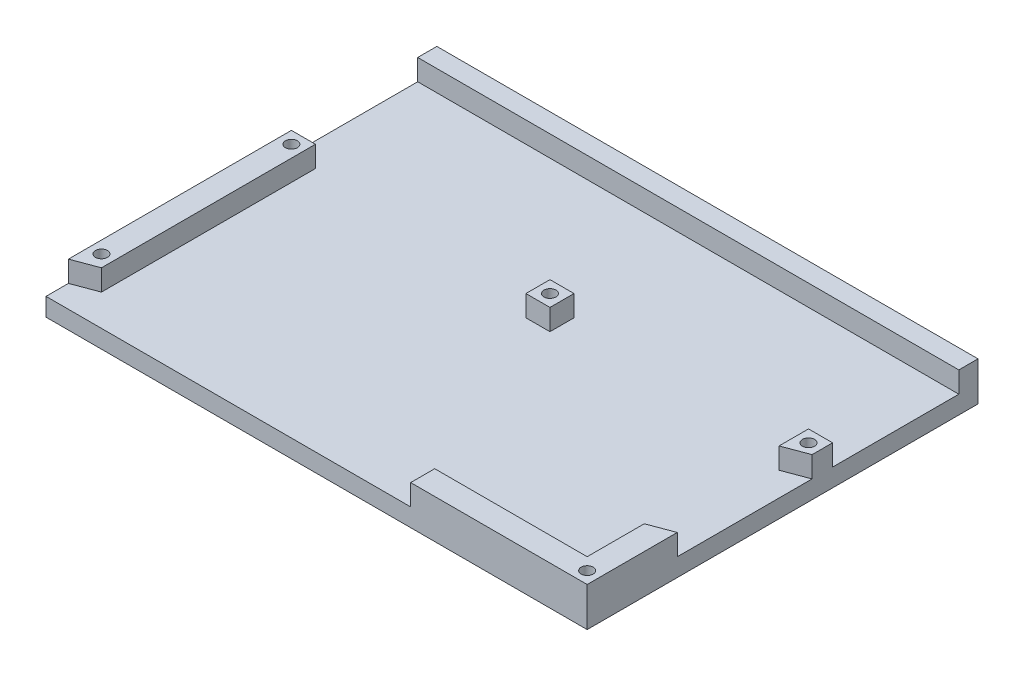
ISO-10303-21;
HEADER;
FILE_DESCRIPTION(('STEP AP214'),'2;1');
FILE_NAME('part.step','',(''),(''),'','','');
FILE_SCHEMA(('AUTOMOTIVE_DESIGN { 1 0 10303 214 1 1 1 1 }'));
ENDSEC;
DATA;
#1=APPLICATION_CONTEXT('core data for automotive mechanical design processes');
#2=APPLICATION_PROTOCOL_DEFINITION('international standard','automotive_design',2000,#1);
#3=PRODUCT_CONTEXT('',#1,'mechanical');
#4=PRODUCT('Part','Part','',(#3));
#5=PRODUCT_RELATED_PRODUCT_CATEGORY('part','',(#4));
#6=PRODUCT_DEFINITION_FORMATION('','',#4);
#7=PRODUCT_DEFINITION_CONTEXT('part definition',#1,'design');
#8=PRODUCT_DEFINITION('design','',#6,#7);
#9=PRODUCT_DEFINITION_SHAPE('','',#8);
#10=(LENGTH_UNIT() NAMED_UNIT(*) SI_UNIT(.MILLI.,.METRE.));
#11=(NAMED_UNIT(*) PLANE_ANGLE_UNIT() SI_UNIT($,.RADIAN.));
#12=(NAMED_UNIT(*) SI_UNIT($,.STERADIAN.) SOLID_ANGLE_UNIT());
#13=UNCERTAINTY_MEASURE_WITH_UNIT(LENGTH_MEASURE(1.E-05),#10,'distance_accuracy_value','');
#14=(GEOMETRIC_REPRESENTATION_CONTEXT(3) GLOBAL_UNCERTAINTY_ASSIGNED_CONTEXT((#13)) GLOBAL_UNIT_ASSIGNED_CONTEXT((#10,
#11,#12)) REPRESENTATION_CONTEXT('',''));
#15=CARTESIAN_POINT('',(0.,0.,0.));
#16=DIRECTION('',(0.,0.,1.));
#17=DIRECTION('',(1.,0.,0.));
#18=AXIS2_PLACEMENT_3D('',#15,#16,#17);
#19=CARTESIAN_POINT('',(0.,3.,0.));
#20=DIRECTION('',(0.,-1.,0.));
#21=DIRECTION('',(0.,0.,-1.));
#22=AXIS2_PLACEMENT_3D('',#19,#20,#21);
#23=PLANE('',#22);
#24=DIRECTION('',(1.,0.,0.));
#25=VECTOR('',#24,1.);
#26=CARTESIAN_POINT('',(0.,3.,-40.8129121657159));
#27=LINE('',#26,#25);
#28=CARTESIAN_POINT('',(43.,3.,-40.8129121657159));
#29=VERTEX_POINT('',#28);
#30=CARTESIAN_POINT('',(47.,3.,-40.8129121657159));
#31=VERTEX_POINT('',#30);
#32=EDGE_CURVE('E326',#29,#31,#27,.T.);
#33=ORIENTED_EDGE('',*,*,#32,.T.);
#34=DIRECTION('',(0.,0.,1.));
#35=VECTOR('',#34,1.);
#36=CARTESIAN_POINT('',(47.,3.,0.));
#37=LINE('',#36,#35);
#38=CARTESIAN_POINT('',(47.,3.,-36.8129121657159));
#39=VERTEX_POINT('',#38);
#40=EDGE_CURVE('E307',#31,#39,#37,.T.);
#41=ORIENTED_EDGE('',*,*,#40,.T.);
#42=DIRECTION('',(1.,0.,0.));
#43=VECTOR('',#42,1.);
#44=CARTESIAN_POINT('',(0.,3.,-36.8129121657159));
#45=LINE('',#44,#43);
#46=CARTESIAN_POINT('',(43.,3.,-36.8129121657159));
#47=VERTEX_POINT('',#46);
#48=EDGE_CURVE('E313',#47,#39,#45,.T.);
#49=ORIENTED_EDGE('',*,*,#48,.F.);
#50=DIRECTION('',(0.,0.,1.));
#51=VECTOR('',#50,1.);
#52=CARTESIAN_POINT('',(43.,3.,0.));
#53=LINE('',#52,#51);
#54=EDGE_CURVE('E329',#29,#47,#53,.T.);
#55=ORIENTED_EDGE('',*,*,#54,.F.);
#56=EDGE_LOOP('',(#33,#41,#49,#55));
#57=FACE_BOUND('',#56,.T.);
#58=DIRECTION('',(0.936563452995251,0.,-0.350498072054059));
#59=VECTOR('',#58,1.);
#60=CARTESIAN_POINT('',(-1.22321837614956,3.,-3.26855328881005));
#61=LINE('',#60,#59);
#62=CARTESIAN_POINT('',(86.0000000000064,3.,-35.9108369284513));
#63=VERTEX_POINT('',#62);
#64=CARTESIAN_POINT('',(90.,3.,-37.4077908013959));
#65=VERTEX_POINT('',#64);
#66=EDGE_CURVE('E63',#63,#65,#61,.T.);
#67=ORIENTED_EDGE('',*,*,#66,.F.);
#68=DIRECTION('',(-1.29943019955387E-12,0.,-1.));
#69=VECTOR('',#68,1.);
#70=CARTESIAN_POINT('',(86.000000000053,3.,-1.11750997161702E-10));
#71=LINE('',#70,#69);
#72=CARTESIAN_POINT('',(86.,3.,-40.8129121657159));
#73=VERTEX_POINT('',#72);
#74=EDGE_CURVE('E68',#63,#73,#71,.T.);
#75=ORIENTED_EDGE('',*,*,#74,.T.);
#76=DIRECTION('',(-1.,0.,0.));
#77=VECTOR('',#76,1.);
#78=CARTESIAN_POINT('',(0.,3.,-40.8129121657159));
#79=LINE('',#78,#77);
#80=CARTESIAN_POINT('',(90.,3.,-40.8129121657159));
#81=VERTEX_POINT('',#80);
#82=EDGE_CURVE('E226',#81,#73,#79,.T.);
#83=ORIENTED_EDGE('',*,*,#82,.F.);
#84=DIRECTION('',(0.,0.,-1.));
#85=VECTOR('',#84,1.);
#86=CARTESIAN_POINT('',(90.,3.,0.));
#87=LINE('',#86,#85);
#88=CARTESIAN_POINT('',(90.,3.,-61.8129121657159));
#89=VERTEX_POINT('',#88);
#90=EDGE_CURVE('E427',#81,#89,#87,.T.);
#91=ORIENTED_EDGE('',*,*,#90,.T.);
#92=DIRECTION('',(1.,0.,0.));
#93=VECTOR('',#92,1.);
#94=CARTESIAN_POINT('',(0.,3.,-61.8129121657159));
#95=LINE('',#94,#93);
#96=CARTESIAN_POINT('',(0.,3.,-61.8129121657159));
#97=VERTEX_POINT('',#96);
#98=EDGE_CURVE('E392',#97,#89,#95,.T.);
#99=ORIENTED_EDGE('',*,*,#98,.F.);
#100=DIRECTION('',(0.,0.,1.));
#101=VECTOR('',#100,1.);
#102=CARTESIAN_POINT('',(0.,3.,0.));
#103=LINE('',#102,#101);
#104=CARTESIAN_POINT('',(0.,3.,-40.8129121657159));
#105=VERTEX_POINT('',#104);
#106=EDGE_CURVE('E420',#97,#105,#103,.T.);
#107=ORIENTED_EDGE('',*,*,#106,.T.);
#108=DIRECTION('',(1.,0.,0.));
#109=VECTOR('',#108,1.);
#110=CARTESIAN_POINT('',(0.,3.,-40.8129121657159));
#111=LINE('',#110,#109);
#112=CARTESIAN_POINT('',(3.99999999999997,3.,-40.8129121657159));
#113=VERTEX_POINT('',#112);
#114=EDGE_CURVE('E357',#105,#113,#111,.T.);
#115=ORIENTED_EDGE('',*,*,#114,.T.);
#116=DIRECTION('',(2.68789889276363E-13,0.,1.));
#117=VECTOR('',#116,1.);
#118=CARTESIAN_POINT('',(4.00000000001094,3.,-1.07515955710839E-12));
#119=LINE('',#118,#117);
#120=CARTESIAN_POINT('',(4.00000000000954,3.,-5.22328253333626));
#121=VERTEX_POINT('',#120);
#122=EDGE_CURVE('E372',#113,#121,#119,.T.);
#123=ORIENTED_EDGE('',*,*,#122,.T.);
#124=DIRECTION('',(-0.936563452995251,0.,0.350498072054059));
#125=VECTOR('',#124,1.);
#126=CARTESIAN_POINT('',(-1.22321837620675,3.,-3.26855328896287));
#127=LINE('',#126,#125);
#128=CARTESIAN_POINT('',(0.,3.,-3.72632866039169));
#129=VERTEX_POINT('',#128);
#130=EDGE_CURVE('E351',#121,#129,#127,.T.);
#131=ORIENTED_EDGE('',*,*,#130,.T.);
#132=CARTESIAN_POINT('',(0.,3.,0.));
#133=VERTEX_POINT('',#132);
#134=EDGE_CURVE('E424',#129,#133,#103,.T.);
#135=ORIENTED_EDGE('',*,*,#134,.T.);
#136=DIRECTION('',(1.,0.,0.));
#137=VECTOR('',#136,1.);
#138=CARTESIAN_POINT('',(0.,3.,0.));
#139=LINE('',#138,#137);
#140=CARTESIAN_POINT('',(60.6460128306891,3.,0.));
#141=VERTEX_POINT('',#140);
#142=EDGE_CURVE('E423',#133,#141,#139,.T.);
#143=ORIENTED_EDGE('',*,*,#142,.T.);
#144=DIRECTION('',(0.,0.,1.));
#145=VECTOR('',#144,1.);
#146=CARTESIAN_POINT('',(60.6460128306891,3.,0.));
#147=LINE('',#146,#145);
#148=CARTESIAN_POINT('',(60.6460128306891,3.,-4.));
#149=VERTEX_POINT('',#148);
#150=EDGE_CURVE('E257',#149,#141,#147,.T.);
#151=ORIENTED_EDGE('',*,*,#150,.F.);
#152=DIRECTION('',(1.,0.,0.));
#153=VECTOR('',#152,1.);
#154=CARTESIAN_POINT('',(0.,3.,-3.99999999999999));
#155=LINE('',#154,#153);
#156=CARTESIAN_POINT('',(86.,3.,-4.));
#157=VERTEX_POINT('',#156);
#158=EDGE_CURVE('E282',#149,#157,#155,.T.);
#159=ORIENTED_EDGE('',*,*,#158,.T.);
#160=DIRECTION('',(0.,0.,-1.));
#161=VECTOR('',#160,1.);
#162=CARTESIAN_POINT('',(86.,3.,0.));
#163=LINE('',#162,#161);
#164=CARTESIAN_POINT('',(86.,3.,-13.4884373218481));
#165=VERTEX_POINT('',#164);
#166=EDGE_CURVE('E279',#157,#165,#163,.T.);
#167=ORIENTED_EDGE('',*,*,#166,.T.);
#168=DIRECTION('',(0.936563452995869,0.,-0.350498072052407));
#169=VECTOR('',#168,1.);
#170=CARTESIAN_POINT('',(6.13724113690313,3.,16.3992792239578));
#171=LINE('',#170,#169);
#172=CARTESIAN_POINT('',(90.,3.,-14.985391194781));
#173=VERTEX_POINT('',#172);
#174=EDGE_CURVE('E209',#165,#173,#171,.T.);
#175=ORIENTED_EDGE('',*,*,#174,.T.);
#176=EDGE_CURVE('E428',#173,#65,#87,.T.);
#177=ORIENTED_EDGE('',*,*,#176,.T.);
#178=EDGE_LOOP('',(#67,#75,#83,#91,#99,#107,#115,#123,#131,#135,#143,#151,#159,#167,#175,#177));
#179=FACE_BOUND('',#178,.T.);
#180=ADVANCED_FACE('F47',(#57,#179),#23,.F.);
#181=CARTESIAN_POINT('',(0.,3.,0.));
#182=DIRECTION('',(1.,0.,0.));
#183=DIRECTION('',(0.,0.,-1.));
#184=AXIS2_PLACEMENT_3D('',#181,#182,#183);
#185=PLANE('',#184);
#186=DIRECTION('',(0.,0.,1.));
#187=VECTOR('',#186,1.);
#188=CARTESIAN_POINT('',(0.,0.,0.));
#189=LINE('',#188,#187);
#190=CARTESIAN_POINT('',(0.,0.,-65.));
#191=VERTEX_POINT('',#190);
#192=CARTESIAN_POINT('',(0.,0.,0.));
#193=VERTEX_POINT('',#192);
#194=EDGE_CURVE('E419',#191,#193,#189,.T.);
#195=ORIENTED_EDGE('',*,*,#194,.T.);
#196=DIRECTION('',(0.,-1.,0.));
#197=VECTOR('',#196,1.);
#198=CARTESIAN_POINT('',(0.,3.,0.));
#199=LINE('',#198,#197);
#200=EDGE_CURVE('E11',#133,#193,#199,.T.);
#201=ORIENTED_EDGE('',*,*,#200,.F.);
#202=ORIENTED_EDGE('',*,*,#134,.F.);
#203=DIRECTION('',(0.,-1.,0.));
#204=VECTOR('',#203,1.);
#205=CARTESIAN_POINT('',(0.,6.5,-3.72632866039169));
#206=LINE('',#205,#204);
#207=CARTESIAN_POINT('',(0.,6.5,-3.72632866039169));
#208=VERTEX_POINT('',#207);
#209=EDGE_CURVE('E368',#208,#129,#206,.T.);
#210=ORIENTED_EDGE('',*,*,#209,.F.);
#211=DIRECTION('',(0.,0.,1.));
#212=VECTOR('',#211,1.);
#213=CARTESIAN_POINT('',(0.,6.5,0.));
#214=LINE('',#213,#212);
#215=CARTESIAN_POINT('',(0.,6.5,-40.8129121657159));
#216=VERTEX_POINT('',#215);
#217=EDGE_CURVE('E365',#216,#208,#214,.T.);
#218=ORIENTED_EDGE('',*,*,#217,.F.);
#219=DIRECTION('',(0.,-1.,0.));
#220=VECTOR('',#219,1.);
#221=CARTESIAN_POINT('',(0.,6.5,-40.8129121657159));
#222=LINE('',#221,#220);
#223=EDGE_CURVE('E380',#216,#105,#222,.T.);
#224=ORIENTED_EDGE('',*,*,#223,.T.);
#225=ORIENTED_EDGE('',*,*,#106,.F.);
#226=DIRECTION('',(0.,-1.,0.));
#227=VECTOR('',#226,1.);
#228=CARTESIAN_POINT('',(0.,6.5,-61.8129121657159));
#229=LINE('',#228,#227);
#230=CARTESIAN_POINT('',(0.,6.5,-61.8129121657159));
#231=VERTEX_POINT('',#230);
#232=EDGE_CURVE('E415',#231,#97,#229,.T.);
#233=ORIENTED_EDGE('',*,*,#232,.F.);
#234=DIRECTION('',(0.,0.,1.));
#235=VECTOR('',#234,1.);
#236=CARTESIAN_POINT('',(0.,6.5,0.));
#237=LINE('',#236,#235);
#238=CARTESIAN_POINT('',(0.,6.5,-65.));
#239=VERTEX_POINT('',#238);
#240=EDGE_CURVE('E393',#239,#231,#237,.T.);
#241=ORIENTED_EDGE('',*,*,#240,.F.);
#242=DIRECTION('',(0.,-1.,0.));
#243=VECTOR('',#242,1.);
#244=CARTESIAN_POINT('',(0.,3.,-65.));
#245=LINE('',#244,#243);
#246=EDGE_CURVE('E431',#239,#191,#245,.T.);
#247=ORIENTED_EDGE('',*,*,#246,.T.);
#248=EDGE_LOOP('',(#195,#201,#202,#210,#218,#224,#225,#233,#241,#247));
#249=FACE_BOUND('',#248,.T.);
#250=ADVANCED_FACE('F49',(#249),#185,.F.);
#251=CARTESIAN_POINT('',(0.,3.,0.));
#252=DIRECTION('',(0.,0.,-1.));
#253=DIRECTION('',(-1.,0.,0.));
#254=AXIS2_PLACEMENT_3D('',#251,#252,#253);
#255=PLANE('',#254);
#256=DIRECTION('',(1.,0.,0.));
#257=VECTOR('',#256,1.);
#258=CARTESIAN_POINT('',(0.,0.,0.));
#259=LINE('',#258,#257);
#260=CARTESIAN_POINT('',(90.,0.,0.));
#261=VERTEX_POINT('',#260);
#262=EDGE_CURVE('E435',#193,#261,#259,.T.);
#263=ORIENTED_EDGE('',*,*,#262,.T.);
#264=DIRECTION('',(0.,-1.,0.));
#265=VECTOR('',#264,1.);
#266=CARTESIAN_POINT('',(90.,3.,0.));
#267=LINE('',#266,#265);
#268=CARTESIAN_POINT('',(90.,6.5,0.));
#269=VERTEX_POINT('',#268);
#270=EDGE_CURVE('E56',#269,#261,#267,.T.);
#271=ORIENTED_EDGE('',*,*,#270,.F.);
#272=DIRECTION('',(1.,0.,0.));
#273=VECTOR('',#272,1.);
#274=CARTESIAN_POINT('',(0.,6.5,0.));
#275=LINE('',#274,#273);
#276=CARTESIAN_POINT('',(60.6460128306891,6.5,0.));
#277=VERTEX_POINT('',#276);
#278=EDGE_CURVE('E268',#277,#269,#275,.T.);
#279=ORIENTED_EDGE('',*,*,#278,.F.);
#280=DIRECTION('',(0.,-1.,0.));
#281=VECTOR('',#280,1.);
#282=CARTESIAN_POINT('',(60.6460128306891,6.5,0.));
#283=LINE('',#282,#281);
#284=EDGE_CURVE('E291',#277,#141,#283,.T.);
#285=ORIENTED_EDGE('',*,*,#284,.T.);
#286=ORIENTED_EDGE('',*,*,#142,.F.);
#287=ORIENTED_EDGE('',*,*,#200,.T.);
#288=EDGE_LOOP('',(#263,#271,#279,#285,#286,#287));
#289=FACE_BOUND('',#288,.T.);
#290=ADVANCED_FACE('F495',(#289),#255,.F.);
#291=CARTESIAN_POINT('',(90.,3.,0.));
#292=DIRECTION('',(-1.,0.,0.));
#293=DIRECTION('',(0.,0.,1.));
#294=AXIS2_PLACEMENT_3D('',#291,#292,#293);
#295=PLANE('',#294);
#296=DIRECTION('',(0.,0.,-1.));
#297=VECTOR('',#296,1.);
#298=CARTESIAN_POINT('',(90.,0.,0.));
#299=LINE('',#298,#297);
#300=CARTESIAN_POINT('',(90.,0.,-65.));
#301=VERTEX_POINT('',#300);
#302=EDGE_CURVE('E438',#261,#301,#299,.T.);
#303=ORIENTED_EDGE('',*,*,#302,.T.);
#304=DIRECTION('',(0.,-1.,0.));
#305=VECTOR('',#304,1.);
#306=CARTESIAN_POINT('',(90.,3.,-65.));
#307=LINE('',#306,#305);
#308=CARTESIAN_POINT('',(89.9999999999999,6.5,-65.));
#309=VERTEX_POINT('',#308);
#310=EDGE_CURVE('E447',#309,#301,#307,.T.);
#311=ORIENTED_EDGE('',*,*,#310,.F.);
#312=DIRECTION('',(0.,0.,-1.));
#313=VECTOR('',#312,1.);
#314=CARTESIAN_POINT('',(90.,6.5,0.));
#315=LINE('',#314,#313);
#316=CARTESIAN_POINT('',(90.,6.5,-61.8129121657159));
#317=VERTEX_POINT('',#316);
#318=EDGE_CURVE('E400',#317,#309,#315,.T.);
#319=ORIENTED_EDGE('',*,*,#318,.F.);
#320=DIRECTION('',(0.,-1.,0.));
#321=VECTOR('',#320,1.);
#322=CARTESIAN_POINT('',(90.,6.5,-61.8129121657159));
#323=LINE('',#322,#321);
#324=EDGE_CURVE('E408',#317,#89,#323,.T.);
#325=ORIENTED_EDGE('',*,*,#324,.T.);
#326=ORIENTED_EDGE('',*,*,#90,.F.);
#327=DIRECTION('',(0.,-1.,0.));
#328=VECTOR('',#327,1.);
#329=CARTESIAN_POINT('',(90.,6.5,-40.8129121657159));
#330=LINE('',#329,#328);
#331=CARTESIAN_POINT('',(90.,6.5,-40.8129121657159));
#332=VERTEX_POINT('',#331);
#333=EDGE_CURVE('E246',#332,#81,#330,.T.);
#334=ORIENTED_EDGE('',*,*,#333,.F.);
#335=DIRECTION('',(0.,0.,-1.));
#336=VECTOR('',#335,1.);
#337=CARTESIAN_POINT('',(90.,6.5,0.));
#338=LINE('',#337,#336);
#339=CARTESIAN_POINT('',(90.,6.5,-37.4077908013959));
#340=VERTEX_POINT('',#339);
#341=EDGE_CURVE('E219',#340,#332,#338,.T.);
#342=ORIENTED_EDGE('',*,*,#341,.F.);
#343=DIRECTION('',(0.,-1.,0.));
#344=VECTOR('',#343,1.);
#345=CARTESIAN_POINT('',(90.,6.5,-37.4077908013959));
#346=LINE('',#345,#344);
#347=EDGE_CURVE('E210',#340,#65,#346,.T.);
#348=ORIENTED_EDGE('',*,*,#347,.T.);
#349=ORIENTED_EDGE('',*,*,#176,.F.);
#350=DIRECTION('',(0.,-1.,0.));
#351=VECTOR('',#350,1.);
#352=CARTESIAN_POINT('',(90.,6.5,-14.985391194781));
#353=LINE('',#352,#351);
#354=CARTESIAN_POINT('',(90.,6.5,-14.985391194781));
#355=VERTEX_POINT('',#354);
#356=EDGE_CURVE('E275',#355,#173,#353,.T.);
#357=ORIENTED_EDGE('',*,*,#356,.F.);
#358=DIRECTION('',(0.,0.,-1.));
#359=VECTOR('',#358,1.);
#360=CARTESIAN_POINT('',(90.,6.5,0.));
#361=LINE('',#360,#359);
#362=EDGE_CURVE('E272',#269,#355,#361,.T.);
#363=ORIENTED_EDGE('',*,*,#362,.F.);
#364=ORIENTED_EDGE('',*,*,#270,.T.);
#365=EDGE_LOOP('',(#303,#311,#319,#325,#326,#334,#342,#348,#349,#357,#363,#364));
#366=FACE_BOUND('',#365,.T.);
#367=ADVANCED_FACE('F455',(#366),#295,.F.);
#368=CARTESIAN_POINT('',(0.,3.,-65.));
#369=DIRECTION('',(0.,0.,1.));
#370=DIRECTION('',(1.,0.,0.));
#371=AXIS2_PLACEMENT_3D('',#368,#369,#370);
#372=PLANE('',#371);
#373=DIRECTION('',(-1.,0.,0.));
#374=VECTOR('',#373,1.);
#375=CARTESIAN_POINT('',(0.,0.,-65.));
#376=LINE('',#375,#374);
#377=EDGE_CURVE('E441',#301,#191,#376,.T.);
#378=ORIENTED_EDGE('',*,*,#377,.T.);
#379=ORIENTED_EDGE('',*,*,#246,.F.);
#380=DIRECTION('',(-1.,0.,0.));
#381=VECTOR('',#380,1.);
#382=CARTESIAN_POINT('',(0.,6.5,-65.));
#383=LINE('',#382,#381);
#384=EDGE_CURVE('E404',#309,#239,#383,.T.);
#385=ORIENTED_EDGE('',*,*,#384,.F.);
#386=ORIENTED_EDGE('',*,*,#310,.T.);
#387=EDGE_LOOP('',(#378,#379,#385,#386));
#388=FACE_BOUND('',#387,.T.);
#389=ADVANCED_FACE('F464',(#388),#372,.F.);
#390=CARTESIAN_POINT('',(0.,0.,0.));
#391=DIRECTION('',(0.,-1.,0.));
#392=DIRECTION('',(0.,0.,-1.));
#393=AXIS2_PLACEMENT_3D('',#390,#391,#392);
#394=PLANE('',#393);
#395=CARTESIAN_POINT('',(2.00000000000476,0.,-7.22328253333626));
#396=DIRECTION('',(0.,-1.,0.));
#397=DIRECTION('',(0.,0.,-1.));
#398=AXIS2_PLACEMENT_3D('',#395,#396,#397);
#399=CIRCLE('',#398,1.);
#400=CARTESIAN_POINT('',(2.00000000000476,0.,-8.22328253333626));
#401=VERTEX_POINT('',#400);
#402=EDGE_CURVE('E232',#401,#401,#399,.T.);
#403=ORIENTED_EDGE('',*,*,#402,.F.);
#404=EDGE_LOOP('',(#403));
#405=FACE_BOUND('',#404,.T.);
#406=CARTESIAN_POINT('',(88.,0.,-2.));
#407=DIRECTION('',(0.,-1.,0.));
#408=DIRECTION('',(0.,0.,-1.));
#409=AXIS2_PLACEMENT_3D('',#406,#407,#408);
#410=CIRCLE('',#409,0.999999999999998);
#411=CARTESIAN_POINT('',(88.,0.,-3.));
#412=VERTEX_POINT('',#411);
#413=EDGE_CURVE('E759',#412,#412,#410,.T.);
#414=ORIENTED_EDGE('',*,*,#413,.F.);
#415=EDGE_LOOP('',(#414));
#416=FACE_BOUND('',#415,.T.);
#417=CARTESIAN_POINT('',(88.,0.,-38.8129121657159));
#418=DIRECTION('',(0.,-1.,0.));
#419=DIRECTION('',(0.,0.,-1.));
#420=AXIS2_PLACEMENT_3D('',#417,#418,#419);
#421=CIRCLE('',#420,0.999999999999998);
#422=CARTESIAN_POINT('',(88.,0.,-39.8129121657159));
#423=VERTEX_POINT('',#422);
#424=EDGE_CURVE('E754',#423,#423,#421,.T.);
#425=ORIENTED_EDGE('',*,*,#424,.F.);
#426=EDGE_LOOP('',(#425));
#427=FACE_BOUND('',#426,.T.);
#428=CARTESIAN_POINT('',(45.,0.,-38.8129121657159));
#429=DIRECTION('',(0.,-1.,0.));
#430=DIRECTION('',(0.,0.,-1.));
#431=AXIS2_PLACEMENT_3D('',#428,#429,#430);
#432=CIRCLE('',#431,0.999999999999998);
#433=CARTESIAN_POINT('',(45.,0.,-39.8129121657159));
#434=VERTEX_POINT('',#433);
#435=EDGE_CURVE('E763',#434,#434,#432,.T.);
#436=ORIENTED_EDGE('',*,*,#435,.F.);
#437=EDGE_LOOP('',(#436));
#438=FACE_BOUND('',#437,.T.);
#439=CARTESIAN_POINT('',(1.99999999999998,0.,-38.8129121657159));
#440=DIRECTION('',(0.,-1.,0.));
#441=DIRECTION('',(0.,0.,-1.));
#442=AXIS2_PLACEMENT_3D('',#439,#440,#441);
#443=CIRCLE('',#442,1.);
#444=CARTESIAN_POINT('',(1.99999999999998,0.,-39.8129121657159));
#445=VERTEX_POINT('',#444);
#446=EDGE_CURVE('E766',#445,#445,#443,.T.);
#447=ORIENTED_EDGE('',*,*,#446,.F.);
#448=EDGE_LOOP('',(#447));
#449=FACE_BOUND('',#448,.T.);
#450=ORIENTED_EDGE('',*,*,#194,.F.);
#451=ORIENTED_EDGE('',*,*,#377,.F.);
#452=ORIENTED_EDGE('',*,*,#302,.F.);
#453=ORIENTED_EDGE('',*,*,#262,.F.);
#454=EDGE_LOOP('',(#450,#451,#452,#453));
#455=FACE_BOUND('',#454,.T.);
#456=ADVANCED_FACE('F462',(#405,#416,#427,#438,#449,#455),#394,.T.);
#457=CARTESIAN_POINT('',(0.,6.5,-61.8129121657159));
#458=DIRECTION('',(0.,0.,-1.));
#459=DIRECTION('',(-1.,0.,0.));
#460=AXIS2_PLACEMENT_3D('',#457,#458,#459);
#461=PLANE('',#460);
#462=ORIENTED_EDGE('',*,*,#98,.T.);
#463=ORIENTED_EDGE('',*,*,#324,.F.);
#464=DIRECTION('',(1.,0.,0.));
#465=VECTOR('',#464,1.);
#466=CARTESIAN_POINT('',(0.,6.5,-61.8129121657159));
#467=LINE('',#466,#465);
#468=EDGE_CURVE('E397',#231,#317,#467,.T.);
#469=ORIENTED_EDGE('',*,*,#468,.F.);
#470=ORIENTED_EDGE('',*,*,#232,.T.);
#471=EDGE_LOOP('',(#462,#463,#469,#470));
#472=FACE_BOUND('',#471,.T.);
#473=ADVANCED_FACE('F477',(#472),#461,.F.);
#474=CARTESIAN_POINT('',(0.,6.5,0.));
#475=DIRECTION('',(0.,1.,0.));
#476=DIRECTION('',(0.,0.,1.));
#477=AXIS2_PLACEMENT_3D('',#474,#475,#476);
#478=PLANE('',#477);
#479=ORIENTED_EDGE('',*,*,#240,.T.);
#480=ORIENTED_EDGE('',*,*,#468,.T.);
#481=ORIENTED_EDGE('',*,*,#318,.T.);
#482=ORIENTED_EDGE('',*,*,#384,.T.);
#483=EDGE_LOOP('',(#479,#480,#481,#482));
#484=FACE_BOUND('',#483,.T.);
#485=ADVANCED_FACE('F472',(#484),#478,.T.);
#486=CARTESIAN_POINT('',(-1.22321837620675,6.5,-3.26855328896287));
#487=DIRECTION('',(0.350498072054059,0.,0.936563452995251));
#488=DIRECTION('',(0.936563452995251,0.,-0.350498072054059));
#489=AXIS2_PLACEMENT_3D('',#486,#487,#488);
#490=PLANE('',#489);
#491=ORIENTED_EDGE('',*,*,#130,.F.);
#492=DIRECTION('',(0.,-1.,0.));
#493=VECTOR('',#492,1.);
#494=CARTESIAN_POINT('',(4.00000000000954,6.5,-5.22328253333626));
#495=LINE('',#494,#493);
#496=CARTESIAN_POINT('',(4.00000000000954,6.5,-5.22328253333626));
#497=VERTEX_POINT('',#496);
#498=EDGE_CURVE('E388',#497,#121,#495,.T.);
#499=ORIENTED_EDGE('',*,*,#498,.F.);
#500=DIRECTION('',(-0.936563452995251,0.,0.350498072054059));
#501=VECTOR('',#500,1.);
#502=CARTESIAN_POINT('',(-1.22321837620675,6.5,-3.26855328896287));
#503=LINE('',#502,#501);
#504=EDGE_CURVE('E352',#497,#208,#503,.T.);
#505=ORIENTED_EDGE('',*,*,#504,.T.);
#506=ORIENTED_EDGE('',*,*,#209,.T.);
#507=EDGE_LOOP('',(#491,#499,#505,#506));
#508=FACE_BOUND('',#507,.T.);
#509=ADVANCED_FACE('F491',(#508),#490,.T.);
#510=CARTESIAN_POINT('',(4.00000000001094,6.5,-1.07515955710839E-12));
#511=DIRECTION('',(1.,0.,-2.68789889276363E-13));
#512=DIRECTION('',(-2.68789889276363E-13,0.,-1.));
#513=AXIS2_PLACEMENT_3D('',#510,#511,#512);
#514=PLANE('',#513);
#515=ORIENTED_EDGE('',*,*,#122,.F.);
#516=DIRECTION('',(0.,-1.,0.));
#517=VECTOR('',#516,1.);
#518=CARTESIAN_POINT('',(3.99999999999997,6.5,-40.8129121657159));
#519=LINE('',#518,#517);
#520=CARTESIAN_POINT('',(3.99999999999997,6.5,-40.8129121657159));
#521=VERTEX_POINT('',#520);
#522=EDGE_CURVE('E384',#521,#113,#519,.T.);
#523=ORIENTED_EDGE('',*,*,#522,.F.);
#524=DIRECTION('',(2.68789889276363E-13,0.,1.));
#525=VECTOR('',#524,1.);
#526=CARTESIAN_POINT('',(4.00000000001094,6.5,-1.07515955710839E-12));
#527=LINE('',#526,#525);
#528=EDGE_CURVE('E356',#521,#497,#527,.T.);
#529=ORIENTED_EDGE('',*,*,#528,.T.);
#530=ORIENTED_EDGE('',*,*,#498,.T.);
#531=EDGE_LOOP('',(#515,#523,#529,#530));
#532=FACE_BOUND('',#531,.T.);
#533=ADVANCED_FACE('F487',(#532),#514,.T.);
#534=CARTESIAN_POINT('',(0.,6.5,-40.8129121657159));
#535=DIRECTION('',(0.,0.,-1.));
#536=DIRECTION('',(-1.,0.,0.));
#537=AXIS2_PLACEMENT_3D('',#534,#535,#536);
#538=PLANE('',#537);
#539=ORIENTED_EDGE('',*,*,#114,.F.);
#540=ORIENTED_EDGE('',*,*,#223,.F.);
#541=DIRECTION('',(1.,0.,0.));
#542=VECTOR('',#541,1.);
#543=CARTESIAN_POINT('',(0.,6.5,-40.8129121657159));
#544=LINE('',#543,#542);
#545=EDGE_CURVE('E361',#216,#521,#544,.T.);
#546=ORIENTED_EDGE('',*,*,#545,.T.);
#547=ORIENTED_EDGE('',*,*,#522,.T.);
#548=EDGE_LOOP('',(#539,#540,#546,#547));
#549=FACE_BOUND('',#548,.T.);
#550=ADVANCED_FACE('F483',(#549),#538,.T.);
#551=CARTESIAN_POINT('',(0.,6.5,0.));
#552=DIRECTION('',(0.,1.,0.));
#553=DIRECTION('',(0.,0.,1.));
#554=AXIS2_PLACEMENT_3D('',#551,#552,#553);
#555=PLANE('',#554);
#556=CARTESIAN_POINT('',(2.00000000000476,6.5,-7.22328253333626));
#557=DIRECTION('',(0.,1.,0.));
#558=DIRECTION('',(0.,0.,1.));
#559=AXIS2_PLACEMENT_3D('',#556,#557,#558);
#560=CIRCLE('',#559,1.);
#561=CARTESIAN_POINT('',(2.00000000000476,6.5,-6.22328253333626));
#562=VERTEX_POINT('',#561);
#563=EDGE_CURVE('E739',#562,#562,#560,.T.);
#564=ORIENTED_EDGE('',*,*,#563,.F.);
#565=EDGE_LOOP('',(#564));
#566=FACE_BOUND('',#565,.T.);
#567=CARTESIAN_POINT('',(1.99999999999998,6.5,-38.8129121657159));
#568=DIRECTION('',(0.,1.,0.));
#569=DIRECTION('',(0.,0.,1.));
#570=AXIS2_PLACEMENT_3D('',#567,#568,#569);
#571=CIRCLE('',#570,1.);
#572=CARTESIAN_POINT('',(1.99999999999998,6.5,-37.8129121657159));
#573=VERTEX_POINT('',#572);
#574=EDGE_CURVE('E750',#573,#573,#571,.T.);
#575=ORIENTED_EDGE('',*,*,#574,.F.);
#576=EDGE_LOOP('',(#575));
#577=FACE_BOUND('',#576,.T.);
#578=ORIENTED_EDGE('',*,*,#504,.F.);
#579=ORIENTED_EDGE('',*,*,#528,.F.);
#580=ORIENTED_EDGE('',*,*,#545,.F.);
#581=ORIENTED_EDGE('',*,*,#217,.T.);
#582=EDGE_LOOP('',(#578,#579,#580,#581));
#583=FACE_BOUND('',#582,.T.);
#584=ADVANCED_FACE('F588',(#566,#577,#583),#555,.T.);
#585=CARTESIAN_POINT('',(47.,6.5,0.));
#586=DIRECTION('',(1.,0.,0.));
#587=DIRECTION('',(0.,0.,-1.));
#588=AXIS2_PLACEMENT_3D('',#585,#586,#587);
#589=PLANE('',#588);
#590=ORIENTED_EDGE('',*,*,#40,.F.);
#591=DIRECTION('',(0.,-1.,0.));
#592=VECTOR('',#591,1.);
#593=CARTESIAN_POINT('',(47.,6.5,-40.8129121657159));
#594=LINE('',#593,#592);
#595=CARTESIAN_POINT('',(47.,6.5,-40.8129121657159));
#596=VERTEX_POINT('',#595);
#597=EDGE_CURVE('E347',#596,#31,#594,.T.);
#598=ORIENTED_EDGE('',*,*,#597,.F.);
#599=DIRECTION('',(0.,0.,1.));
#600=VECTOR('',#599,1.);
#601=CARTESIAN_POINT('',(47.,6.5,0.));
#602=LINE('',#601,#600);
#603=CARTESIAN_POINT('',(47.,6.5,-36.8129121657159));
#604=VERTEX_POINT('',#603);
#605=EDGE_CURVE('E308',#596,#604,#602,.T.);
#606=ORIENTED_EDGE('',*,*,#605,.T.);
#607=DIRECTION('',(0.,-1.,0.));
#608=VECTOR('',#607,1.);
#609=CARTESIAN_POINT('',(47.,6.5,-36.8129121657159));
#610=LINE('',#609,#608);
#611=EDGE_CURVE('E323',#604,#39,#610,.T.);
#612=ORIENTED_EDGE('',*,*,#611,.T.);
#613=EDGE_LOOP('',(#590,#598,#606,#612));
#614=FACE_BOUND('',#613,.T.);
#615=ADVANCED_FACE('F594',(#614),#589,.T.);
#616=CARTESIAN_POINT('',(0.,6.5,-40.8129121657159));
#617=DIRECTION('',(0.,0.,-1.));
#618=DIRECTION('',(-1.,0.,0.));
#619=AXIS2_PLACEMENT_3D('',#616,#617,#618);
#620=PLANE('',#619);
#621=ORIENTED_EDGE('',*,*,#32,.F.);
#622=DIRECTION('',(0.,-1.,0.));
#623=VECTOR('',#622,1.);
#624=CARTESIAN_POINT('',(43.,6.5,-40.8129121657159));
#625=LINE('',#624,#623);
#626=CARTESIAN_POINT('',(43.,6.5,-40.8129121657159));
#627=VERTEX_POINT('',#626);
#628=EDGE_CURVE('E343',#627,#29,#625,.T.);
#629=ORIENTED_EDGE('',*,*,#628,.F.);
#630=DIRECTION('',(1.,0.,0.));
#631=VECTOR('',#630,1.);
#632=CARTESIAN_POINT('',(0.,6.5,-40.8129121657159));
#633=LINE('',#632,#631);
#634=EDGE_CURVE('E312',#627,#596,#633,.T.);
#635=ORIENTED_EDGE('',*,*,#634,.T.);
#636=ORIENTED_EDGE('',*,*,#597,.T.);
#637=EDGE_LOOP('',(#621,#629,#635,#636));
#638=FACE_BOUND('',#637,.T.);
#639=ADVANCED_FACE('F598',(#638),#620,.T.);
#640=CARTESIAN_POINT('',(43.,6.5,0.));
#641=DIRECTION('',(1.,0.,0.));
#642=DIRECTION('',(0.,0.,-1.));
#643=AXIS2_PLACEMENT_3D('',#640,#641,#642);
#644=PLANE('',#643);
#645=ORIENTED_EDGE('',*,*,#54,.T.);
#646=DIRECTION('',(0.,-1.,0.));
#647=VECTOR('',#646,1.);
#648=CARTESIAN_POINT('',(43.,6.5,-36.8129121657159));
#649=LINE('',#648,#647);
#650=CARTESIAN_POINT('',(43.,6.5,-36.8129121657159));
#651=VERTEX_POINT('',#650);
#652=EDGE_CURVE('E339',#651,#47,#649,.T.);
#653=ORIENTED_EDGE('',*,*,#652,.F.);
#654=DIRECTION('',(0.,0.,1.));
#655=VECTOR('',#654,1.);
#656=CARTESIAN_POINT('',(43.,6.5,0.));
#657=LINE('',#656,#655);
#658=EDGE_CURVE('E317',#627,#651,#657,.T.);
#659=ORIENTED_EDGE('',*,*,#658,.F.);
#660=ORIENTED_EDGE('',*,*,#628,.T.);
#661=EDGE_LOOP('',(#645,#653,#659,#660));
#662=FACE_BOUND('',#661,.T.);
#663=ADVANCED_FACE('F607',(#662),#644,.F.);
#664=CARTESIAN_POINT('',(0.,6.5,-36.8129121657159));
#665=DIRECTION('',(0.,0.,-1.));
#666=DIRECTION('',(-1.,0.,0.));
#667=AXIS2_PLACEMENT_3D('',#664,#665,#666);
#668=PLANE('',#667);
#669=ORIENTED_EDGE('',*,*,#48,.T.);
#670=ORIENTED_EDGE('',*,*,#611,.F.);
#671=DIRECTION('',(1.,0.,0.));
#672=VECTOR('',#671,1.);
#673=CARTESIAN_POINT('',(0.,6.5,-36.8129121657159));
#674=LINE('',#673,#672);
#675=EDGE_CURVE('E320',#651,#604,#674,.T.);
#676=ORIENTED_EDGE('',*,*,#675,.F.);
#677=ORIENTED_EDGE('',*,*,#652,.T.);
#678=EDGE_LOOP('',(#669,#670,#676,#677));
#679=FACE_BOUND('',#678,.T.);
#680=ADVANCED_FACE('F616',(#679),#668,.F.);
#681=CARTESIAN_POINT('',(0.,6.5,0.));
#682=DIRECTION('',(0.,1.,0.));
#683=DIRECTION('',(0.,0.,1.));
#684=AXIS2_PLACEMENT_3D('',#681,#682,#683);
#685=PLANE('',#684);
#686=CARTESIAN_POINT('',(45.,6.5,-38.8129121657159));
#687=DIRECTION('',(0.,1.,0.));
#688=DIRECTION('',(0.,0.,1.));
#689=AXIS2_PLACEMENT_3D('',#686,#687,#688);
#690=CIRCLE('',#689,0.999999999999998);
#691=CARTESIAN_POINT('',(45.,6.5,-37.8129121657159));
#692=VERTEX_POINT('',#691);
#693=EDGE_CURVE('E755',#692,#692,#690,.T.);
#694=ORIENTED_EDGE('',*,*,#693,.F.);
#695=EDGE_LOOP('',(#694));
#696=FACE_BOUND('',#695,.T.);
#697=ORIENTED_EDGE('',*,*,#605,.F.);
#698=ORIENTED_EDGE('',*,*,#634,.F.);
#699=ORIENTED_EDGE('',*,*,#658,.T.);
#700=ORIENTED_EDGE('',*,*,#675,.T.);
#701=EDGE_LOOP('',(#697,#698,#699,#700));
#702=FACE_BOUND('',#701,.T.);
#703=ADVANCED_FACE('F625',(#696,#702),#685,.T.);
#704=CARTESIAN_POINT('',(6.13724113690313,6.5,16.3992792239578));
#705=DIRECTION('',(-0.350498072052407,0.,-0.936563452995869));
#706=DIRECTION('',(-0.936563452995869,0.,0.350498072052407));
#707=AXIS2_PLACEMENT_3D('',#704,#705,#706);
#708=PLANE('',#707);
#709=ORIENTED_EDGE('',*,*,#174,.F.);
#710=DIRECTION('',(0.,-1.,0.));
#711=VECTOR('',#710,1.);
#712=CARTESIAN_POINT('',(86.,6.5,-13.4884373218481));
#713=LINE('',#712,#711);
#714=CARTESIAN_POINT('',(86.,6.5,-13.4884373218481));
#715=VERTEX_POINT('',#714);
#716=EDGE_CURVE('E303',#715,#165,#713,.T.);
#717=ORIENTED_EDGE('',*,*,#716,.F.);
#718=DIRECTION('',(0.936563452995869,0.,-0.350498072052407));
#719=VECTOR('',#718,1.);
#720=CARTESIAN_POINT('',(6.13724113690313,6.5,16.3992792239578));
#721=LINE('',#720,#719);
#722=EDGE_CURVE('E252',#715,#355,#721,.T.);
#723=ORIENTED_EDGE('',*,*,#722,.T.);
#724=ORIENTED_EDGE('',*,*,#356,.T.);
#725=EDGE_LOOP('',(#709,#717,#723,#724));
#726=FACE_BOUND('',#725,.T.);
#727=ADVANCED_FACE('F511',(#726),#708,.T.);
#728=CARTESIAN_POINT('',(86.,6.5,0.));
#729=DIRECTION('',(-1.,0.,0.));
#730=DIRECTION('',(0.,0.,1.));
#731=AXIS2_PLACEMENT_3D('',#728,#729,#730);
#732=PLANE('',#731);
#733=ORIENTED_EDGE('',*,*,#166,.F.);
#734=DIRECTION('',(0.,-1.,0.));
#735=VECTOR('',#734,1.);
#736=CARTESIAN_POINT('',(86.,6.5,-4.));
#737=LINE('',#736,#735);
#738=CARTESIAN_POINT('',(86.,6.5,-4.));
#739=VERTEX_POINT('',#738);
#740=EDGE_CURVE('E299',#739,#157,#737,.T.);
#741=ORIENTED_EDGE('',*,*,#740,.F.);
#742=DIRECTION('',(0.,0.,-1.));
#743=VECTOR('',#742,1.);
#744=CARTESIAN_POINT('',(86.,6.5,0.));
#745=LINE('',#744,#743);
#746=EDGE_CURVE('E256',#739,#715,#745,.T.);
#747=ORIENTED_EDGE('',*,*,#746,.T.);
#748=ORIENTED_EDGE('',*,*,#716,.T.);
#749=EDGE_LOOP('',(#733,#741,#747,#748));
#750=FACE_BOUND('',#749,.T.);
#751=ADVANCED_FACE('F507',(#750),#732,.T.);
#752=CARTESIAN_POINT('',(0.,6.5,-3.99999999999999));
#753=DIRECTION('',(0.,0.,-1.));
#754=DIRECTION('',(-1.,0.,0.));
#755=AXIS2_PLACEMENT_3D('',#752,#753,#754);
#756=PLANE('',#755);
#757=ORIENTED_EDGE('',*,*,#158,.F.);
#758=DIRECTION('',(0.,-1.,0.));
#759=VECTOR('',#758,1.);
#760=CARTESIAN_POINT('',(60.6460128306891,6.5,-4.));
#761=LINE('',#760,#759);
#762=CARTESIAN_POINT('',(60.6460128306891,6.5,-4.));
#763=VERTEX_POINT('',#762);
#764=EDGE_CURVE('E295',#763,#149,#761,.T.);
#765=ORIENTED_EDGE('',*,*,#764,.F.);
#766=DIRECTION('',(1.,0.,0.));
#767=VECTOR('',#766,1.);
#768=CARTESIAN_POINT('',(0.,6.5,-3.99999999999999));
#769=LINE('',#768,#767);
#770=EDGE_CURVE('E261',#763,#739,#769,.T.);
#771=ORIENTED_EDGE('',*,*,#770,.T.);
#772=ORIENTED_EDGE('',*,*,#740,.T.);
#773=EDGE_LOOP('',(#757,#765,#771,#772));
#774=FACE_BOUND('',#773,.T.);
#775=ADVANCED_FACE('F504',(#774),#756,.T.);
#776=CARTESIAN_POINT('',(60.6460128306891,6.5,0.));
#777=DIRECTION('',(1.,0.,0.));
#778=DIRECTION('',(0.,0.,-1.));
#779=AXIS2_PLACEMENT_3D('',#776,#777,#778);
#780=PLANE('',#779);
#781=ORIENTED_EDGE('',*,*,#150,.T.);
#782=ORIENTED_EDGE('',*,*,#284,.F.);
#783=DIRECTION('',(0.,0.,1.));
#784=VECTOR('',#783,1.);
#785=CARTESIAN_POINT('',(60.6460128306891,6.5,0.));
#786=LINE('',#785,#784);
#787=EDGE_CURVE('E265',#763,#277,#786,.T.);
#788=ORIENTED_EDGE('',*,*,#787,.F.);
#789=ORIENTED_EDGE('',*,*,#764,.T.);
#790=EDGE_LOOP('',(#781,#782,#788,#789));
#791=FACE_BOUND('',#790,.T.);
#792=ADVANCED_FACE('F499',(#791),#780,.F.);
#793=CARTESIAN_POINT('',(0.,6.5,0.));
#794=DIRECTION('',(0.,1.,0.));
#795=DIRECTION('',(0.,0.,1.));
#796=AXIS2_PLACEMENT_3D('',#793,#794,#795);
#797=PLANE('',#796);
#798=CARTESIAN_POINT('',(88.,6.5,-2.));
#799=DIRECTION('',(0.,1.,0.));
#800=DIRECTION('',(0.,0.,1.));
#801=AXIS2_PLACEMENT_3D('',#798,#799,#800);
#802=CIRCLE('',#801,0.999999999999998);
#803=CARTESIAN_POINT('',(88.,6.5,-1.));
#804=VERTEX_POINT('',#803);
#805=EDGE_CURVE('E742',#804,#804,#802,.T.);
#806=ORIENTED_EDGE('',*,*,#805,.F.);
#807=EDGE_LOOP('',(#806));
#808=FACE_BOUND('',#807,.T.);
#809=ORIENTED_EDGE('',*,*,#722,.F.);
#810=ORIENTED_EDGE('',*,*,#746,.F.);
#811=ORIENTED_EDGE('',*,*,#770,.F.);
#812=ORIENTED_EDGE('',*,*,#787,.T.);
#813=ORIENTED_EDGE('',*,*,#278,.T.);
#814=ORIENTED_EDGE('',*,*,#362,.T.);
#815=EDGE_LOOP('',(#809,#810,#811,#812,#813,#814));
#816=FACE_BOUND('',#815,.T.);
#817=ADVANCED_FACE('F656',(#808,#816),#797,.T.);
#818=CARTESIAN_POINT('',(86.000000000053,6.5,-1.11750997161702E-10));
#819=DIRECTION('',(-1.,0.,1.29943019955387E-12));
#820=DIRECTION('',(1.29943019955387E-12,0.,1.));
#821=AXIS2_PLACEMENT_3D('',#818,#819,#820);
#822=PLANE('',#821);
#823=ORIENTED_EDGE('',*,*,#74,.F.);
#824=DIRECTION('',(0.,-1.,0.));
#825=VECTOR('',#824,1.);
#826=CARTESIAN_POINT('',(86.0000000000064,6.5,-35.9108369284513));
#827=LINE('',#826,#825);
#828=CARTESIAN_POINT('',(86.0000000000064,6.5,-35.9108369284513));
#829=VERTEX_POINT('',#828);
#830=EDGE_CURVE('E202',#829,#63,#827,.T.);
#831=ORIENTED_EDGE('',*,*,#830,.F.);
#832=DIRECTION('',(-1.29943019955387E-12,0.,-1.));
#833=VECTOR('',#832,1.);
#834=CARTESIAN_POINT('',(86.000000000053,6.5,-1.11750997161702E-10));
#835=LINE('',#834,#833);
#836=CARTESIAN_POINT('',(86.,6.5,-40.8129121657159));
#837=VERTEX_POINT('',#836);
#838=EDGE_CURVE('E206',#829,#837,#835,.T.);
#839=ORIENTED_EDGE('',*,*,#838,.T.);
#840=DIRECTION('',(0.,-1.,0.));
#841=VECTOR('',#840,1.);
#842=CARTESIAN_POINT('',(86.,6.5,-40.8129121657159));
#843=LINE('',#842,#841);
#844=EDGE_CURVE('E239',#837,#73,#843,.T.);
#845=ORIENTED_EDGE('',*,*,#844,.T.);
#846=EDGE_LOOP('',(#823,#831,#839,#845));
#847=FACE_BOUND('',#846,.T.);
#848=ADVANCED_FACE('F204',(#847),#822,.T.);
#849=CARTESIAN_POINT('',(-1.22321837614956,6.5,-3.26855328881005));
#850=DIRECTION('',(-0.350498072054059,0.,-0.936563452995251));
#851=DIRECTION('',(-0.936563452995251,0.,0.350498072054059));
#852=AXIS2_PLACEMENT_3D('',#849,#850,#851);
#853=PLANE('',#852);
#854=ORIENTED_EDGE('',*,*,#66,.T.);
#855=ORIENTED_EDGE('',*,*,#347,.F.);
#856=DIRECTION('',(0.936563452995251,0.,-0.350498072054059));
#857=VECTOR('',#856,1.);
#858=CARTESIAN_POINT('',(-1.22321837614956,6.5,-3.26855328881005));
#859=LINE('',#858,#857);
#860=EDGE_CURVE('E213',#829,#340,#859,.T.);
#861=ORIENTED_EDGE('',*,*,#860,.F.);
#862=ORIENTED_EDGE('',*,*,#830,.T.);
#863=EDGE_LOOP('',(#854,#855,#861,#862));
#864=FACE_BOUND('',#863,.T.);
#865=ADVANCED_FACE('F214',(#864),#853,.F.);
#866=CARTESIAN_POINT('',(0.,6.5,-40.8129121657159));
#867=DIRECTION('',(0.,0.,1.));
#868=DIRECTION('',(1.,0.,0.));
#869=AXIS2_PLACEMENT_3D('',#866,#867,#868);
#870=PLANE('',#869);
#871=ORIENTED_EDGE('',*,*,#82,.T.);
#872=ORIENTED_EDGE('',*,*,#844,.F.);
#873=DIRECTION('',(-1.,0.,0.));
#874=VECTOR('',#873,1.);
#875=CARTESIAN_POINT('',(0.,6.5,-40.8129121657159));
#876=LINE('',#875,#874);
#877=EDGE_CURVE('E223',#332,#837,#876,.T.);
#878=ORIENTED_EDGE('',*,*,#877,.F.);
#879=ORIENTED_EDGE('',*,*,#333,.T.);
#880=EDGE_LOOP('',(#871,#872,#878,#879));
#881=FACE_BOUND('',#880,.T.);
#882=ADVANCED_FACE('F513',(#881),#870,.F.);
#883=CARTESIAN_POINT('',(0.,6.5,0.));
#884=DIRECTION('',(0.,1.,0.));
#885=DIRECTION('',(0.,0.,1.));
#886=AXIS2_PLACEMENT_3D('',#883,#884,#885);
#887=PLANE('',#886);
#888=CARTESIAN_POINT('',(88.,6.5,-38.8129121657159));
#889=DIRECTION('',(0.,1.,0.));
#890=DIRECTION('',(0.,0.,1.));
#891=AXIS2_PLACEMENT_3D('',#888,#889,#890);
#892=CIRCLE('',#891,0.999999999999998);
#893=CARTESIAN_POINT('',(88.,6.5,-37.8129121657159));
#894=VERTEX_POINT('',#893);
#895=EDGE_CURVE('E746',#894,#894,#892,.T.);
#896=ORIENTED_EDGE('',*,*,#895,.F.);
#897=EDGE_LOOP('',(#896));
#898=FACE_BOUND('',#897,.T.);
#899=ORIENTED_EDGE('',*,*,#838,.F.);
#900=ORIENTED_EDGE('',*,*,#860,.T.);
#901=ORIENTED_EDGE('',*,*,#341,.T.);
#902=ORIENTED_EDGE('',*,*,#877,.T.);
#903=EDGE_LOOP('',(#899,#900,#901,#902));
#904=FACE_BOUND('',#903,.T.);
#905=ADVANCED_FACE('F221',(#898,#904),#887,.T.);
#906=CARTESIAN_POINT('',(88.,-8.,-38.8129121657159));
#907=DIRECTION('',(0.,1.,0.));
#908=DIRECTION('',(0.,0.,1.));
#909=AXIS2_PLACEMENT_3D('',#906,#907,#908);
#910=CYLINDRICAL_SURFACE('',#909,0.999999999999998);
#911=ORIENTED_EDGE('',*,*,#424,.T.);
#912=EDGE_LOOP('',(#911));
#913=FACE_BOUND('',#912,.T.);
#914=ORIENTED_EDGE('',*,*,#895,.T.);
#915=EDGE_LOOP('',(#914));
#916=FACE_BOUND('',#915,.T.);
#917=ADVANCED_FACE('F521',(#913,#916),#910,.F.);
#918=CARTESIAN_POINT('',(88.,-8.,-2.));
#919=DIRECTION('',(0.,1.,0.));
#920=DIRECTION('',(0.,0.,1.));
#921=AXIS2_PLACEMENT_3D('',#918,#919,#920);
#922=CYLINDRICAL_SURFACE('',#921,0.999999999999998);
#923=ORIENTED_EDGE('',*,*,#413,.T.);
#924=EDGE_LOOP('',(#923));
#925=FACE_BOUND('',#924,.T.);
#926=ORIENTED_EDGE('',*,*,#805,.T.);
#927=EDGE_LOOP('',(#926));
#928=FACE_BOUND('',#927,.T.);
#929=ADVANCED_FACE('F691',(#925,#928),#922,.F.);
#930=CARTESIAN_POINT('',(45.,-8.,-38.8129121657159));
#931=DIRECTION('',(0.,1.,0.));
#932=DIRECTION('',(0.,0.,1.));
#933=AXIS2_PLACEMENT_3D('',#930,#931,#932);
#934=CYLINDRICAL_SURFACE('',#933,0.999999999999998);
#935=ORIENTED_EDGE('',*,*,#435,.T.);
#936=EDGE_LOOP('',(#935));
#937=FACE_BOUND('',#936,.T.);
#938=ORIENTED_EDGE('',*,*,#693,.T.);
#939=EDGE_LOOP('',(#938));
#940=FACE_BOUND('',#939,.T.);
#941=ADVANCED_FACE('F701',(#937,#940),#934,.F.);
#942=CARTESIAN_POINT('',(1.99999999999998,-8.,-38.8129121657159));
#943=DIRECTION('',(0.,1.,0.));
#944=DIRECTION('',(0.,0.,1.));
#945=AXIS2_PLACEMENT_3D('',#942,#943,#944);
#946=CYLINDRICAL_SURFACE('',#945,1.);
#947=ORIENTED_EDGE('',*,*,#446,.T.);
#948=EDGE_LOOP('',(#947));
#949=FACE_BOUND('',#948,.T.);
#950=ORIENTED_EDGE('',*,*,#574,.T.);
#951=EDGE_LOOP('',(#950));
#952=FACE_BOUND('',#951,.T.);
#953=ADVANCED_FACE('F711',(#949,#952),#946,.F.);
#954=CARTESIAN_POINT('',(2.00000000000476,-8.,-7.22328253333626));
#955=DIRECTION('',(0.,1.,0.));
#956=DIRECTION('',(0.,0.,1.));
#957=AXIS2_PLACEMENT_3D('',#954,#955,#956);
#958=CYLINDRICAL_SURFACE('',#957,1.);
#959=ORIENTED_EDGE('',*,*,#402,.T.);
#960=EDGE_LOOP('',(#959));
#961=FACE_BOUND('',#960,.T.);
#962=ORIENTED_EDGE('',*,*,#563,.T.);
#963=EDGE_LOOP('',(#962));
#964=FACE_BOUND('',#963,.T.);
#965=ADVANCED_FACE('F721',(#961,#964),#958,.F.);
#966=CLOSED_SHELL('',(#180,#250,#290,#367,#389,#456,#473,#485,#509,#533,#550,#584,#615,#639,
#663,#680,#703,#727,#751,#775,#792,#817,#848,#865,#882,#905,#917,#929,#941,#953,#965));
#967=MANIFOLD_SOLID_BREP('B2',#966);
#968=ADVANCED_BREP_SHAPE_REPRESENTATION('',(#18,#967),#14);
#969=SHAPE_DEFINITION_REPRESENTATION(#9,#968);
ENDSEC;
END-ISO-10303-21;
